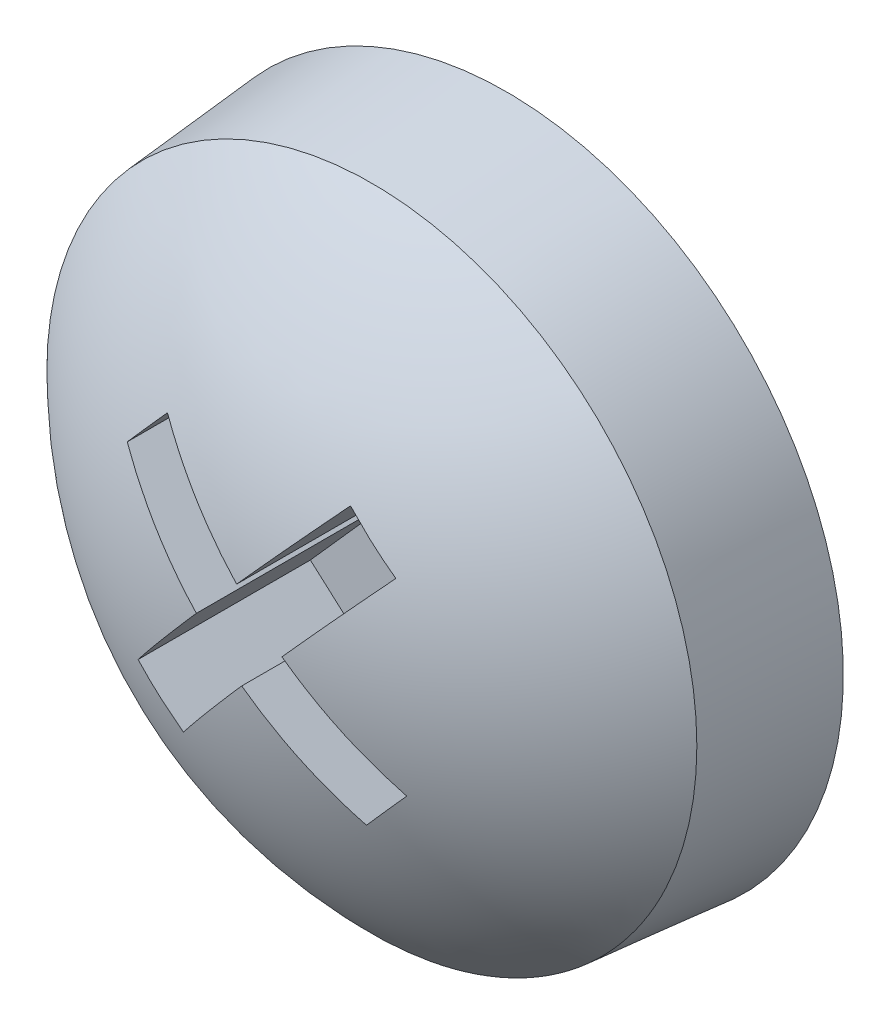
ISO-10303-21;
HEADER;
FILE_DESCRIPTION(('STEP AP214'),'2;1');
FILE_NAME('part.step','',(''),(''),'','','');
FILE_SCHEMA(('AUTOMOTIVE_DESIGN { 1 0 10303 214 1 1 1 1 }'));
ENDSEC;
DATA;
#1=APPLICATION_CONTEXT('core data for automotive mechanical design processes');
#2=APPLICATION_PROTOCOL_DEFINITION('international standard','automotive_design',2000,#1);
#3=PRODUCT_CONTEXT('',#1,'mechanical');
#4=PRODUCT('Part','Part','',(#3));
#5=PRODUCT_RELATED_PRODUCT_CATEGORY('part','',(#4));
#6=PRODUCT_DEFINITION_FORMATION('','',#4);
#7=PRODUCT_DEFINITION_CONTEXT('part definition',#1,'design');
#8=PRODUCT_DEFINITION('design','',#6,#7);
#9=PRODUCT_DEFINITION_SHAPE('','',#8);
#10=(LENGTH_UNIT() NAMED_UNIT(*) SI_UNIT(.MILLI.,.METRE.));
#11=(NAMED_UNIT(*) PLANE_ANGLE_UNIT() SI_UNIT($,.RADIAN.));
#12=(NAMED_UNIT(*) SI_UNIT($,.STERADIAN.) SOLID_ANGLE_UNIT());
#13=UNCERTAINTY_MEASURE_WITH_UNIT(LENGTH_MEASURE(1.E-05),#10,'distance_accuracy_value','');
#14=(GEOMETRIC_REPRESENTATION_CONTEXT(3) GLOBAL_UNCERTAINTY_ASSIGNED_CONTEXT((#13)) GLOBAL_UNIT_ASSIGNED_CONTEXT((#10,
#11,#12)) REPRESENTATION_CONTEXT('',''));
#15=CARTESIAN_POINT('',(0.,0.,0.));
#16=DIRECTION('',(0.,0.,1.));
#17=DIRECTION('',(1.,0.,0.));
#18=AXIS2_PLACEMENT_3D('',#15,#16,#17);
#19=CARTESIAN_POINT('',(6.89997712496555,4.50501230247056,21.6));
#20=DIRECTION('',(0.,0.,1.));
#21=DIRECTION('',(0.,-1.,0.));
#22=AXIS2_PLACEMENT_3D('',#19,#20,#21);
#23=PLANE('',#22);
#24=DIRECTION('',(0.747876143588401,-0.66383828893138,0.));
#25=VECTOR('',#24,1.);
#26=CARTESIAN_POINT('',(7.0194680169732,4.63963000831647,21.6));
#27=LINE('',#26,#25);
#28=CARTESIAN_POINT('',(7.15408572281911,4.52013911630882,21.6));
#29=VERTEX_POINT('',#28);
#30=CARTESIAN_POINT('',(7.72995035338218,4.00898363383166,21.6));
#31=VERTEX_POINT('',#30);
#32=EDGE_CURVE('E84',#29,#31,#27,.T.);
#33=ORIENTED_EDGE('',*,*,#32,.F.);
#34=DIRECTION('',(-0.66383828893138,-0.747876143588401,0.));
#35=VECTOR('',#34,1.);
#36=CARTESIAN_POINT('',(7.03459483081146,4.38552141046291,21.6));
#37=LINE('',#36,#35);
#38=CARTESIAN_POINT('',(7.66524120529627,5.09600374687189,21.6));
#39=VERTEX_POINT('',#38);
#40=EDGE_CURVE('E89',#39,#29,#37,.T.);
#41=ORIENTED_EDGE('',*,*,#40,.F.);
#42=DIRECTION('',(0.747876143588401,-0.66383828893138,0.));
#43=VECTOR('',#42,1.);
#44=CARTESIAN_POINT('',(7.53062349945036,5.21549463887954,21.6));
#45=LINE('',#44,#43);
#46=CARTESIAN_POINT('',(7.39600579360445,5.33498553088719,21.6));
#47=VERTEX_POINT('',#46);
#48=EDGE_CURVE('E140',#47,#39,#45,.T.);
#49=ORIENTED_EDGE('',*,*,#48,.F.);
#50=DIRECTION('',(0.66383828893138,0.747876143588401,0.));
#51=VECTOR('',#50,1.);
#52=CARTESIAN_POINT('',(6.76535941911964,4.62450319447821,21.6));
#53=LINE('',#52,#51);
#54=CARTESIAN_POINT('',(6.88485031112729,4.75912090032412,21.6));
#55=VERTEX_POINT('',#54);
#56=EDGE_CURVE('E151',#55,#47,#53,.T.);
#57=ORIENTED_EDGE('',*,*,#56,.F.);
#58=DIRECTION('',(0.747876143588401,-0.66383828893138,0.));
#59=VECTOR('',#58,1.);
#60=CARTESIAN_POINT('',(7.0194680169732,4.63963000831647,21.6));
#61=LINE('',#60,#59);
#62=CARTESIAN_POINT('',(6.30898568056422,5.27027638280128,21.6));
#63=VERTEX_POINT('',#62);
#64=EDGE_CURVE('E154',#63,#55,#61,.T.);
#65=ORIENTED_EDGE('',*,*,#64,.F.);
#66=DIRECTION('',(0.66383828893138,0.747876143588401,0.));
#67=VECTOR('',#66,1.);
#68=CARTESIAN_POINT('',(6.18949478855657,5.13565867695537,21.6));
#69=LINE('',#68,#67);
#70=CARTESIAN_POINT('',(6.07000389654892,5.00104097110945,21.6));
#71=VERTEX_POINT('',#70);
#72=EDGE_CURVE('E162',#71,#63,#69,.T.);
#73=ORIENTED_EDGE('',*,*,#72,.F.);
#74=DIRECTION('',(-0.747876143588401,0.66383828893138,0.));
#75=VECTOR('',#74,1.);
#76=CARTESIAN_POINT('',(6.7804862329579,4.37039459662465,21.6));
#77=LINE('',#76,#75);
#78=CARTESIAN_POINT('',(6.64586852711199,4.4898854886323,21.6));
#79=VERTEX_POINT('',#78);
#80=EDGE_CURVE('E167',#79,#71,#77,.T.);
#81=ORIENTED_EDGE('',*,*,#80,.F.);
#82=DIRECTION('',(0.66383828893138,0.747876143588401,0.));
#83=VECTOR('',#82,1.);
#84=CARTESIAN_POINT('',(6.76535941911964,4.62450319447821,21.6));
#85=LINE('',#84,#83);
#86=CARTESIAN_POINT('',(6.13471304463483,3.91402085806923,21.6));
#87=VERTEX_POINT('',#86);
#88=EDGE_CURVE('E172',#87,#79,#85,.T.);
#89=ORIENTED_EDGE('',*,*,#88,.F.);
#90=DIRECTION('',(0.747876143588401,-0.66383828893138,0.));
#91=VECTOR('',#90,1.);
#92=CARTESIAN_POINT('',(6.26933075048074,3.79452996606158,21.6));
#93=LINE('',#92,#91);
#94=CARTESIAN_POINT('',(6.40394845632666,3.67503907405393,21.6));
#95=VERTEX_POINT('',#94);
#96=EDGE_CURVE('E178',#87,#95,#93,.T.);
#97=ORIENTED_EDGE('',*,*,#96,.T.);
#98=DIRECTION('',(-0.66383828893138,-0.747876143588401,0.));
#99=VECTOR('',#98,1.);
#100=CARTESIAN_POINT('',(7.03459483081146,4.38552141046291,21.6));
#101=LINE('',#100,#99);
#102=CARTESIAN_POINT('',(6.91510393880381,4.250903704617,21.6));
#103=VERTEX_POINT('',#102);
#104=EDGE_CURVE('E183',#103,#95,#101,.T.);
#105=ORIENTED_EDGE('',*,*,#104,.F.);
#106=DIRECTION('',(-0.747876143588401,0.66383828893138,0.));
#107=VECTOR('',#106,1.);
#108=CARTESIAN_POINT('',(6.7804862329579,4.37039459662465,21.6));
#109=LINE('',#108,#107);
#110=CARTESIAN_POINT('',(7.49096856936688,3.73974822213984,21.6));
#111=VERTEX_POINT('',#110);
#112=EDGE_CURVE('E119',#111,#103,#109,.T.);
#113=ORIENTED_EDGE('',*,*,#112,.F.);
#114=DIRECTION('',(0.66383828893138,0.747876143588401,0.));
#115=VECTOR('',#114,1.);
#116=CARTESIAN_POINT('',(7.61045946137453,3.87436592798575,21.6));
#117=LINE('',#116,#115);
#118=EDGE_CURVE('E117',#111,#31,#117,.T.);
#119=ORIENTED_EDGE('',*,*,#118,.T.);
#120=EDGE_LOOP('',(#33,#41,#49,#57,#65,#73,#81,#89,#97,#105,#113,#119));
#121=FACE_BOUND('',#120,.T.);
#122=ADVANCED_FACE('F17',(#121),#23,.T.);
#123=CARTESIAN_POINT('',(7.0194680169732,4.63963000831647,22.2));
#124=DIRECTION('',(-0.66383828893138,-0.747876143588401,0.));
#125=DIRECTION('',(0.747876143588401,-0.66383828893138,0.));
#126=AXIS2_PLACEMENT_3D('',#123,#124,#125);
#127=PLANE('',#126);
#128=DIRECTION('',(0.,0.,1.));
#129=VECTOR('',#128,1.);
#130=CARTESIAN_POINT('',(7.15408572281911,4.52013911630882,22.2));
#131=LINE('',#130,#129);
#132=CARTESIAN_POINT('',(7.15408572281911,4.52013911630882,22.788097569794));
#133=VERTEX_POINT('',#132);
#134=EDGE_CURVE('E127',#29,#133,#131,.T.);
#135=ORIENTED_EDGE('',*,*,#134,.F.);
#136=ORIENTED_EDGE('',*,*,#32,.T.);
#137=DIRECTION('',(0.,0.,1.));
#138=VECTOR('',#137,1.);
#139=CARTESIAN_POINT('',(7.72995035338218,4.00898363383166,22.2));
#140=LINE('',#139,#138);
#141=CARTESIAN_POINT('',(7.72995035338218,4.00898363383166,22.6229045231911));
#142=VERTEX_POINT('',#141);
#143=EDGE_CURVE('E123',#31,#142,#140,.T.);
#144=ORIENTED_EDGE('',*,*,#143,.T.);
#145=CARTESIAN_POINT('',(7.15408572281911,4.52013911630882,22.788097569794));
#146=CARTESIAN_POINT('',(7.17877165659901,4.49822710830909,22.7859104299673));
#147=CARTESIAN_POINT('',(7.20342772135599,4.47634161298961,22.7831210421487));
#148=CARTESIAN_POINT('',(7.25255070327682,4.43273851567851,22.7763560552392));
#149=CARTESIAN_POINT('',(7.27701798297534,4.41102059188977,22.7723851623111));
#150=CARTESIAN_POINT('',(7.32576464164366,4.36775153088425,22.7632701136372));
#151=CARTESIAN_POINT('',(7.35004434494988,4.34620010577631,22.7581290588921));
#152=CARTESIAN_POINT('',(7.39841672115628,4.30326326960671,22.7466823115268));
#153=CARTESIAN_POINT('',(7.42250959829504,4.2818776772565,22.7403781619621));
#154=CARTESIAN_POINT('',(7.47050909335735,4.23927182206924,22.7266089835755));
#155=CARTESIAN_POINT('',(7.49441571128089,4.2180515592322,22.7191439547536));
#156=CARTESIAN_POINT('',(7.5420428123996,4.17577625257286,22.703052205587));
#157=CARTESIAN_POINT('',(7.56576300849104,4.15472146359282,22.6944239659575));
#158=CARTESIAN_POINT('',(7.61301615058749,4.11277809467423,22.6760004253173));
#159=CARTESIAN_POINT('',(7.63654844108106,4.09189009658817,22.666202118307));
#160=CARTESIAN_POINT('',(7.68342385204351,4.05028201365486,22.6454289197685));
#161=CARTESIAN_POINT('',(7.70676585941599,4.02956291682685,22.6344495373844));
#162=CARTESIAN_POINT('',(7.72995035338216,4.00898363383167,22.622904523191));
#163=B_SPLINE_CURVE_WITH_KNOTS('',3,(#145,#146,#147,#148,#149,#150,#151,#152,#153,#154,#155,
#156,#157,#158,#159,#160,#161,#162),.UNSPECIFIED.,.F.,.F.,(4,2,2,2,2,2,2,2,4),(0.,
0.0992357442434159,0.198081387639265,0.296668072480489,0.395124892694088,0.493581712907686,
0.59216839774891,0.691014041144759,0.790249785388174),.UNSPECIFIED.);
#164=EDGE_CURVE('E20',#133,#142,#163,.T.);
#165=ORIENTED_EDGE('',*,*,#164,.F.);
#166=EDGE_LOOP('',(#135,#136,#144,#165));
#167=FACE_BOUND('',#166,.T.);
#168=ADVANCED_FACE('F125',(#167),#127,.T.);
#169=CARTESIAN_POINT('',(7.61045946137453,3.87436592798575,22.2));
#170=DIRECTION('',(0.747876143588401,-0.66383828893138,0.));
#171=DIRECTION('',(0.66383828893138,0.747876143588401,0.));
#172=AXIS2_PLACEMENT_3D('',#169,#170,#171);
#173=PLANE('',#172);
#174=ORIENTED_EDGE('',*,*,#118,.F.);
#175=DIRECTION('',(0.,0.,1.));
#176=VECTOR('',#175,1.);
#177=CARTESIAN_POINT('',(7.49096856936688,3.73974822213984,22.2));
#178=LINE('',#177,#176);
#179=CARTESIAN_POINT('',(7.49096856936687,3.73974822213984,22.6229045231911));
#180=VERTEX_POINT('',#179);
#181=EDGE_CURVE('E132',#180,#111,#178,.F.);
#182=ORIENTED_EDGE('',*,*,#181,.F.);
#183=CARTESIAN_POINT('',(7.72995035338218,4.00898363383166,22.622904523191));
#184=CARTESIAN_POINT('',(7.69012005604629,3.96411106521635,22.6271329188894));
#185=CARTESIAN_POINT('',(7.65028975871041,3.91923849660105,22.6292471167385));
#186=CARTESIAN_POINT('',(7.57062916403865,3.82949335937045,22.6292471167385));
#187=CARTESIAN_POINT('',(7.53079886670277,3.78462079075514,22.6271329188894));
#188=CARTESIAN_POINT('',(7.49096856936688,3.73974822213984,22.622904523191));
#189=B_SPLINE_CURVE_WITH_KNOTS('',3,(#183,#184,#185,#186,#187,#188),.UNSPECIFIED.,.F.,.F.,(4,2,
4),(0.,0.180111711148685,0.360223422297369),.UNSPECIFIED.);
#190=EDGE_CURVE('E131',#142,#180,#189,.T.);
#191=ORIENTED_EDGE('',*,*,#190,.F.);
#192=ORIENTED_EDGE('',*,*,#143,.F.);
#193=EDGE_LOOP('',(#174,#182,#191,#192));
#194=FACE_BOUND('',#193,.T.);
#195=ADVANCED_FACE('F129',(#194),#173,.F.);
#196=CARTESIAN_POINT('',(6.7804862329579,4.37039459662465,22.2));
#197=DIRECTION('',(0.66383828893138,0.747876143588401,0.));
#198=DIRECTION('',(-0.747876143588401,0.66383828893138,0.));
#199=AXIS2_PLACEMENT_3D('',#196,#197,#198);
#200=PLANE('',#199);
#201=DIRECTION('',(0.,0.,1.));
#202=VECTOR('',#201,1.);
#203=CARTESIAN_POINT('',(6.91510393880381,4.250903704617,22.2));
#204=LINE('',#203,#202);
#205=CARTESIAN_POINT('',(6.91510393880381,4.250903704617,22.788097569794));
#206=VERTEX_POINT('',#205);
#207=EDGE_CURVE('E180',#206,#103,#204,.F.);
#208=ORIENTED_EDGE('',*,*,#207,.F.);
#209=CARTESIAN_POINT('',(7.49096856936687,3.73974822213985,22.622904523191));
#210=CARTESIAN_POINT('',(7.46778407540069,3.76032750513502,22.6344495373844));
#211=CARTESIAN_POINT('',(7.44444206802821,3.78104660196304,22.6454289197685));
#212=CARTESIAN_POINT('',(7.39756665706576,3.82265468489635,22.666202118307));
#213=CARTESIAN_POINT('',(7.37403436657219,3.84354268298241,22.6760004253173));
#214=CARTESIAN_POINT('',(7.32678122447574,3.885486051901,22.6944239659575));
#215=CARTESIAN_POINT('',(7.3030610283843,3.90654084088104,22.703052205587));
#216=CARTESIAN_POINT('',(7.25543392726559,3.94881614754038,22.7191439547536));
#217=CARTESIAN_POINT('',(7.23152730934205,3.97003641037742,22.7266089835755));
#218=CARTESIAN_POINT('',(7.18352781427975,4.01264226556468,22.7403781619621));
#219=CARTESIAN_POINT('',(7.15943493714099,4.03402785791489,22.7466823115268));
#220=CARTESIAN_POINT('',(7.11106256093458,4.07696469408448,22.7581290588921));
#221=CARTESIAN_POINT('',(7.08678285762836,4.09851611919243,22.7632701136372));
#222=CARTESIAN_POINT('',(7.03803619896004,4.14178518019794,22.7723851623111));
#223=CARTESIAN_POINT('',(7.01356891926152,4.16350310398668,22.7763560552392));
#224=CARTESIAN_POINT('',(6.96444593734069,4.20710620129778,22.7831210421487));
#225=CARTESIAN_POINT('',(6.93978987258371,4.22899169661727,22.7859104299673));
#226=CARTESIAN_POINT('',(6.91510393880381,4.250903704617,22.788097569794));
#227=B_SPLINE_CURVE_WITH_KNOTS('',3,(#209,#210,#211,#212,#213,#214,#215,#216,#217,#218,#219,
#220,#221,#222,#223,#224,#225,#226),.UNSPECIFIED.,.F.,.F.,(4,2,2,2,2,2,2,2,4),(0.,
0.0992357442434137,0.198081387639264,0.296668072480488,0.395124892694088,0.493581712907684,
0.59216839774891,0.691014041144758,0.790249785388173),.UNSPECIFIED.);
#228=EDGE_CURVE('E296',#180,#206,#227,.T.);
#229=ORIENTED_EDGE('',*,*,#228,.F.);
#230=ORIENTED_EDGE('',*,*,#181,.T.);
#231=ORIENTED_EDGE('',*,*,#112,.T.);
#232=EDGE_LOOP('',(#208,#229,#230,#231));
#233=FACE_BOUND('',#232,.T.);
#234=ADVANCED_FACE('F305',(#233),#200,.T.);
#235=CARTESIAN_POINT('',(7.03459483081146,4.38552141046291,22.2));
#236=DIRECTION('',(-0.747876143588401,0.66383828893138,0.));
#237=DIRECTION('',(-0.66383828893138,-0.747876143588401,0.));
#238=AXIS2_PLACEMENT_3D('',#235,#236,#237);
#239=PLANE('',#238);
#240=CARTESIAN_POINT('',(6.91510393880381,4.250903704617,22.788097569794));
#241=CARTESIAN_POINT('',(6.89319193080408,4.2262177708371,22.7859104299673));
#242=CARTESIAN_POINT('',(6.8713064354846,4.20156170608012,22.7831210421487));
#243=CARTESIAN_POINT('',(6.8277033381735,4.15243872415929,22.7763560552392));
#244=CARTESIAN_POINT('',(6.80598541438476,4.12797144446077,22.7723851623111));
#245=CARTESIAN_POINT('',(6.76271635337924,4.07922478579245,22.7632701136372));
#246=CARTESIAN_POINT('',(6.7411649282713,4.05494508248623,22.7581290588921));
#247=CARTESIAN_POINT('',(6.6982280921017,4.00657270627983,22.7466823115268));
#248=CARTESIAN_POINT('',(6.67684249975149,3.98247982914107,22.740378161962));
#249=CARTESIAN_POINT('',(6.63423664456424,3.93448033407876,22.7266089835755));
#250=CARTESIAN_POINT('',(6.61301638172719,3.91057371615522,22.7191439547536));
#251=CARTESIAN_POINT('',(6.57074107506785,3.86294661503651,22.703052205587));
#252=CARTESIAN_POINT('',(6.54968628608781,3.83922641894507,22.6944239659575));
#253=CARTESIAN_POINT('',(6.50774291716923,3.79197327684862,22.6760004253173));
#254=CARTESIAN_POINT('',(6.48685491908316,3.76844098635505,22.666202118307));
#255=CARTESIAN_POINT('',(6.44524683614985,3.7215655753926,22.6454289197685));
#256=CARTESIAN_POINT('',(6.42452773932184,3.69822356802012,22.6344495373844));
#257=CARTESIAN_POINT('',(6.40394845632667,3.67503907405395,22.622904523191));
#258=B_SPLINE_CURVE_WITH_KNOTS('',3,(#240,#241,#242,#243,#244,#245,#246,#247,#248,#249,#250,
#251,#252,#253,#254,#255,#256,#257),.UNSPECIFIED.,.F.,.F.,(4,2,2,2,2,2,2,2,4),(0.,
0.0992357442434143,0.198081387639265,0.29666807248049,0.395124892694087,0.493581712907686,
0.59216839774891,0.691014041144758,0.790249785388174),.UNSPECIFIED.);
#259=CARTESIAN_POINT('',(6.40394845632665,3.67503907405393,22.6229045231911));
#260=VERTEX_POINT('',#259);
#261=EDGE_CURVE('E289',#206,#260,#258,.T.);
#262=ORIENTED_EDGE('',*,*,#261,.F.);
#263=ORIENTED_EDGE('',*,*,#207,.T.);
#264=ORIENTED_EDGE('',*,*,#104,.T.);
#265=DIRECTION('',(0.,0.,1.));
#266=VECTOR('',#265,1.);
#267=CARTESIAN_POINT('',(6.40394845632666,3.67503907405393,22.2));
#268=LINE('',#267,#266);
#269=EDGE_CURVE('E175',#95,#260,#268,.T.);
#270=ORIENTED_EDGE('',*,*,#269,.T.);
#271=EDGE_LOOP('',(#262,#263,#264,#270));
#272=FACE_BOUND('',#271,.T.);
#273=ADVANCED_FACE('F302',(#272),#239,.T.);
#274=CARTESIAN_POINT('',(6.26933075048074,3.79452996606158,22.2));
#275=DIRECTION('',(-0.66383828893138,-0.747876143588401,0.));
#276=DIRECTION('',(0.747876143588401,-0.66383828893138,0.));
#277=AXIS2_PLACEMENT_3D('',#274,#275,#276);
#278=PLANE('',#277);
#279=ORIENTED_EDGE('',*,*,#96,.F.);
#280=DIRECTION('',(0.,0.,1.));
#281=VECTOR('',#280,1.);
#282=CARTESIAN_POINT('',(6.13471304463483,3.91402085806923,22.2));
#283=LINE('',#282,#281);
#284=CARTESIAN_POINT('',(6.13471304463484,3.91402085806924,22.6229045231911));
#285=VERTEX_POINT('',#284);
#286=EDGE_CURVE('E174',#285,#87,#283,.F.);
#287=ORIENTED_EDGE('',*,*,#286,.F.);
#288=CARTESIAN_POINT('',(6.40394845632665,3.67503907405393,22.622904523191));
#289=CARTESIAN_POINT('',(6.35907588771134,3.71486937138982,22.6271329188894));
#290=CARTESIAN_POINT('',(6.31420331909604,3.7546996687257,22.6292471167385));
#291=CARTESIAN_POINT('',(6.22445818186544,3.83436026339746,22.6292471167385));
#292=CARTESIAN_POINT('',(6.17958561325013,3.87419056073334,22.6271329188894));
#293=CARTESIAN_POINT('',(6.13471304463483,3.91402085806922,22.622904523191));
#294=B_SPLINE_CURVE_WITH_KNOTS('',3,(#288,#289,#290,#291,#292,#293),.UNSPECIFIED.,.F.,.F.,(4,2,
4),(0.,0.180111711148683,0.360223422297365),.UNSPECIFIED.);
#295=EDGE_CURVE('E282',#260,#285,#294,.T.);
#296=ORIENTED_EDGE('',*,*,#295,.F.);
#297=ORIENTED_EDGE('',*,*,#269,.F.);
#298=EDGE_LOOP('',(#279,#287,#296,#297));
#299=FACE_BOUND('',#298,.T.);
#300=ADVANCED_FACE('F271',(#299),#278,.F.);
#301=CARTESIAN_POINT('',(6.76535941911964,4.62450319447821,22.2));
#302=DIRECTION('',(0.747876143588401,-0.66383828893138,0.));
#303=DIRECTION('',(0.66383828893138,0.747876143588401,0.));
#304=AXIS2_PLACEMENT_3D('',#301,#302,#303);
#305=PLANE('',#304);
#306=CARTESIAN_POINT('',(6.13471304463484,3.91402085806925,22.622904523191));
#307=CARTESIAN_POINT('',(6.15529232763002,3.93720535203542,22.6344495373844));
#308=CARTESIAN_POINT('',(6.17601142445803,3.9605473594079,22.6454289197685));
#309=CARTESIAN_POINT('',(6.21761950739134,4.00742277037035,22.666202118307));
#310=CARTESIAN_POINT('',(6.23850750547741,4.03095506086392,22.6760004253173));
#311=CARTESIAN_POINT('',(6.28045087439599,4.07820820296037,22.6944239659575));
#312=CARTESIAN_POINT('',(6.30150566337603,4.10192839905181,22.703052205587));
#313=CARTESIAN_POINT('',(6.34378097003537,4.14955550017052,22.7191439547536));
#314=CARTESIAN_POINT('',(6.36500123287242,4.17346211809406,22.7266089835755));
#315=CARTESIAN_POINT('',(6.40760708805967,4.22146161315636,22.7403781619621));
#316=CARTESIAN_POINT('',(6.42899268040988,4.24555449029512,22.7466823115268));
#317=CARTESIAN_POINT('',(6.47192951657947,4.29392686650153,22.7581290588921));
#318=CARTESIAN_POINT('',(6.49348094168742,4.31820656980775,22.7632701136372));
#319=CARTESIAN_POINT('',(6.53675000269294,4.36695322847607,22.7723851623111));
#320=CARTESIAN_POINT('',(6.55846792648168,4.39142050817459,22.7763560552392));
#321=CARTESIAN_POINT('',(6.60207102379277,4.44054349009542,22.7831210421487));
#322=CARTESIAN_POINT('',(6.62395651911226,4.4651995548524,22.7859104299673));
#323=CARTESIAN_POINT('',(6.64586852711199,4.4898854886323,22.788097569794));
#324=B_SPLINE_CURVE_WITH_KNOTS('',3,(#306,#307,#308,#309,#310,#311,#312,#313,#314,#315,#316,
#317,#318,#319,#320,#321,#322,#323),.UNSPECIFIED.,.F.,.F.,(4,2,2,2,2,2,2,2,4),(0.,
0.0992357442434144,0.198081387639263,0.296668072480489,0.395124892694086,0.493581712907683,
0.592168397748908,0.691014041144757,0.790249785388172),.UNSPECIFIED.);
#325=CARTESIAN_POINT('',(6.64586852711199,4.4898854886323,22.788097569794));
#326=VERTEX_POINT('',#325);
#327=EDGE_CURVE('E275',#285,#326,#324,.T.);
#328=ORIENTED_EDGE('',*,*,#327,.F.);
#329=ORIENTED_EDGE('',*,*,#286,.T.);
#330=ORIENTED_EDGE('',*,*,#88,.T.);
#331=DIRECTION('',(0.,0.,1.));
#332=VECTOR('',#331,1.);
#333=CARTESIAN_POINT('',(6.64586852711199,4.4898854886323,22.2));
#334=LINE('',#333,#332);
#335=EDGE_CURVE('E169',#326,#79,#334,.F.);
#336=ORIENTED_EDGE('',*,*,#335,.F.);
#337=EDGE_LOOP('',(#328,#329,#330,#336));
#338=FACE_BOUND('',#337,.T.);
#339=ADVANCED_FACE('F266',(#338),#305,.T.);
#340=CARTESIAN_POINT('',(6.7804862329579,4.37039459662465,22.2));
#341=DIRECTION('',(0.66383828893138,0.747876143588401,0.));
#342=DIRECTION('',(-0.747876143588401,0.66383828893138,0.));
#343=AXIS2_PLACEMENT_3D('',#340,#341,#342);
#344=PLANE('',#343);
#345=ORIENTED_EDGE('',*,*,#335,.T.);
#346=ORIENTED_EDGE('',*,*,#80,.T.);
#347=DIRECTION('',(0.,0.,1.));
#348=VECTOR('',#347,1.);
#349=CARTESIAN_POINT('',(6.07000389654892,5.00104097110945,22.2));
#350=LINE('',#349,#348);
#351=CARTESIAN_POINT('',(6.07000389654892,5.00104097110945,22.6229045231911));
#352=VERTEX_POINT('',#351);
#353=EDGE_CURVE('E164',#352,#71,#350,.F.);
#354=ORIENTED_EDGE('',*,*,#353,.F.);
#355=CARTESIAN_POINT('',(6.64586852711199,4.4898854886323,22.788097569794));
#356=CARTESIAN_POINT('',(6.62118259333209,4.51179749663203,22.7859104299673));
#357=CARTESIAN_POINT('',(6.59652652857511,4.53368299195151,22.7831210421487));
#358=CARTESIAN_POINT('',(6.54740354665428,4.57728608926261,22.7763560552392));
#359=CARTESIAN_POINT('',(6.52293626695576,4.59900401305135,22.7723851623111));
#360=CARTESIAN_POINT('',(6.47418960828744,4.64227307405687,22.7632701136372));
#361=CARTESIAN_POINT('',(6.44990990498122,4.66382449916481,22.7581290588921));
#362=CARTESIAN_POINT('',(6.40153752877482,4.70676133533441,22.7466823115268));
#363=CARTESIAN_POINT('',(6.37744465163606,4.72814692768462,22.740378161962));
#364=CARTESIAN_POINT('',(6.32944515657375,4.77075278287187,22.7266089835755));
#365=CARTESIAN_POINT('',(6.30553853865021,4.79197304570891,22.7191439547536));
#366=CARTESIAN_POINT('',(6.25791143753151,4.83424835236825,22.703052205587));
#367=CARTESIAN_POINT('',(6.23419124144006,4.8553031413483,22.6944239659575));
#368=CARTESIAN_POINT('',(6.18693809934361,4.89724651026688,22.6760004253173));
#369=CARTESIAN_POINT('',(6.16340580885004,4.91813450835295,22.666202118307));
#370=CARTESIAN_POINT('',(6.11653039788759,4.95974259128625,22.6454289197685));
#371=CARTESIAN_POINT('',(6.09318839051511,4.98046168811427,22.6344495373844));
#372=CARTESIAN_POINT('',(6.07000389654894,5.00104097110944,22.622904523191));
#373=B_SPLINE_CURVE_WITH_KNOTS('',3,(#355,#356,#357,#358,#359,#360,#361,#362,#363,#364,#365,
#366,#367,#368,#369,#370,#371,#372),.UNSPECIFIED.,.F.,.F.,(4,2,2,2,2,2,2,2,4),(0.,
0.0992357442434133,0.198081387639264,0.296668072480487,0.395124892694085,0.493581712907682,
0.592168397748905,0.691014041144755,0.790249785388168),.UNSPECIFIED.);
#374=EDGE_CURVE('E251',#326,#352,#373,.T.);
#375=ORIENTED_EDGE('',*,*,#374,.F.);
#376=EDGE_LOOP('',(#345,#346,#354,#375));
#377=FACE_BOUND('',#376,.T.);
#378=ADVANCED_FACE('F261',(#377),#344,.T.);
#379=CARTESIAN_POINT('',(6.18949478855657,5.13565867695537,22.2));
#380=DIRECTION('',(0.747876143588401,-0.66383828893138,0.));
#381=DIRECTION('',(0.66383828893138,0.747876143588401,0.));
#382=AXIS2_PLACEMENT_3D('',#379,#380,#381);
#383=PLANE('',#382);
#384=ORIENTED_EDGE('',*,*,#353,.T.);
#385=ORIENTED_EDGE('',*,*,#72,.T.);
#386=DIRECTION('',(0.,0.,1.));
#387=VECTOR('',#386,1.);
#388=CARTESIAN_POINT('',(6.30898568056422,5.27027638280128,22.2));
#389=LINE('',#388,#387);
#390=CARTESIAN_POINT('',(6.30898568056423,5.27027638280127,22.6229045231911));
#391=VERTEX_POINT('',#390);
#392=EDGE_CURVE('E159',#391,#63,#389,.F.);
#393=ORIENTED_EDGE('',*,*,#392,.F.);
#394=CARTESIAN_POINT('',(6.07000389654892,5.00104097110946,22.622904523191));
#395=CARTESIAN_POINT('',(6.1098341938848,5.04591353972476,22.6271329188894));
#396=CARTESIAN_POINT('',(6.14966449122069,5.09078610834006,22.6292471167385));
#397=CARTESIAN_POINT('',(6.22932508589245,5.18053124557067,22.6292471167385));
#398=CARTESIAN_POINT('',(6.26915538322833,5.22540381418597,22.6271329188894));
#399=CARTESIAN_POINT('',(6.30898568056421,5.27027638280128,22.622904523191));
#400=B_SPLINE_CURVE_WITH_KNOTS('',3,(#394,#395,#396,#397,#398,#399),.UNSPECIFIED.,.F.,.F.,(4,2,
4),(0.,0.180111711148686,0.360223422297372),.UNSPECIFIED.);
#401=EDGE_CURVE('E244',#352,#391,#400,.T.);
#402=ORIENTED_EDGE('',*,*,#401,.F.);
#403=EDGE_LOOP('',(#384,#385,#393,#402));
#404=FACE_BOUND('',#403,.T.);
#405=ADVANCED_FACE('F258',(#404),#383,.T.);
#406=CARTESIAN_POINT('',(7.0194680169732,4.63963000831647,22.2));
#407=DIRECTION('',(-0.66383828893138,-0.747876143588401,0.));
#408=DIRECTION('',(0.747876143588401,-0.66383828893138,0.));
#409=AXIS2_PLACEMENT_3D('',#406,#407,#408);
#410=PLANE('',#409);
#411=DIRECTION('',(0.,0.,1.));
#412=VECTOR('',#411,1.);
#413=CARTESIAN_POINT('',(6.88485031112729,4.75912090032412,22.2));
#414=LINE('',#413,#412);
#415=CARTESIAN_POINT('',(6.88485031112729,4.75912090032412,22.788097569794));
#416=VERTEX_POINT('',#415);
#417=EDGE_CURVE('E143',#416,#55,#414,.F.);
#418=ORIENTED_EDGE('',*,*,#417,.F.);
#419=CARTESIAN_POINT('',(6.30898568056423,5.27027638280127,22.622904523191));
#420=CARTESIAN_POINT('',(6.3321701745304,5.2496970998061,22.6344495373844));
#421=CARTESIAN_POINT('',(6.35551218190288,5.22897800297808,22.6454289197685));
#422=CARTESIAN_POINT('',(6.40238759286533,5.18736992004477,22.666202118307));
#423=CARTESIAN_POINT('',(6.42591988335891,5.16648192195871,22.6760004253173));
#424=CARTESIAN_POINT('',(6.47317302545535,5.12453855304012,22.6944239659575));
#425=CARTESIAN_POINT('',(6.4968932215468,5.10348376406008,22.703052205587));
#426=CARTESIAN_POINT('',(6.54452032266551,5.06120845740074,22.7191439547536));
#427=CARTESIAN_POINT('',(6.56842694058905,5.03998819456369,22.7266089835755));
#428=CARTESIAN_POINT('',(6.61642643565135,4.99738233937644,22.740378161962));
#429=CARTESIAN_POINT('',(6.64051931279011,4.97599674702623,22.7466823115268));
#430=CARTESIAN_POINT('',(6.68889168899652,4.93305991085663,22.7581290588921));
#431=CARTESIAN_POINT('',(6.71317139230274,4.91150848574869,22.7632701136372));
#432=CARTESIAN_POINT('',(6.76191805097105,4.86823942474317,22.7723851623111));
#433=CARTESIAN_POINT('',(6.78638533066957,4.84652150095443,22.7763560552392));
#434=CARTESIAN_POINT('',(6.83550831259041,4.80291840364334,22.7831210421487));
#435=CARTESIAN_POINT('',(6.86016437734739,4.78103290832385,22.7859104299673));
#436=CARTESIAN_POINT('',(6.88485031112729,4.75912090032412,22.788097569794));
#437=B_SPLINE_CURVE_WITH_KNOTS('',3,(#419,#420,#421,#422,#423,#424,#425,#426,#427,#428,#429,
#430,#431,#432,#433,#434,#435,#436),.UNSPECIFIED.,.F.,.F.,(4,2,2,2,2,2,2,2,4),(0.,
0.0992357442434146,0.198081387639264,0.296668072480489,0.395124892694087,0.493581712907685,
0.59216839774891,0.691014041144759,0.790249785388175),.UNSPECIFIED.);
#438=EDGE_CURVE('E237',#391,#416,#437,.T.);
#439=ORIENTED_EDGE('',*,*,#438,.F.);
#440=ORIENTED_EDGE('',*,*,#392,.T.);
#441=ORIENTED_EDGE('',*,*,#64,.T.);
#442=EDGE_LOOP('',(#418,#439,#440,#441));
#443=FACE_BOUND('',#442,.T.);
#444=ADVANCED_FACE('F226',(#443),#410,.T.);
#445=CARTESIAN_POINT('',(6.76535941911964,4.62450319447821,22.2));
#446=DIRECTION('',(0.747876143588401,-0.66383828893138,0.));
#447=DIRECTION('',(0.66383828893138,0.747876143588401,0.));
#448=AXIS2_PLACEMENT_3D('',#445,#446,#447);
#449=PLANE('',#448);
#450=CARTESIAN_POINT('',(6.88485031112729,4.75912090032412,22.788097569794));
#451=CARTESIAN_POINT('',(6.90676231912702,4.78380683410401,22.7859104299673));
#452=CARTESIAN_POINT('',(6.9286478144465,4.808462898861,22.7831210421487));
#453=CARTESIAN_POINT('',(6.9722509117576,4.85758588078183,22.7763560552392));
#454=CARTESIAN_POINT('',(6.99396883554634,4.88205316048035,22.7723851623111));
#455=CARTESIAN_POINT('',(7.03723789655185,4.93079981914866,22.7632701136372));
#456=CARTESIAN_POINT('',(7.0587893216598,4.95507952245489,22.7581290588921));
#457=CARTESIAN_POINT('',(7.10172615782939,5.00345189866129,22.7466823115268));
#458=CARTESIAN_POINT('',(7.1231117501796,5.02754477580005,22.7403781619621));
#459=CARTESIAN_POINT('',(7.16571760536686,5.07554427086235,22.7266089835755));
#460=CARTESIAN_POINT('',(7.1869378682039,5.09945088878589,22.7191439547536));
#461=CARTESIAN_POINT('',(7.22921317486324,5.1470779899046,22.703052205587));
#462=CARTESIAN_POINT('',(7.25026796384328,5.17079818599605,22.6944239659575));
#463=CARTESIAN_POINT('',(7.29221133276187,5.21805132809249,22.6760004253173));
#464=CARTESIAN_POINT('',(7.31309933084793,5.24158361858606,22.666202118307));
#465=CARTESIAN_POINT('',(7.35470741378124,5.28845902954851,22.6454289197685));
#466=CARTESIAN_POINT('',(7.37542651060926,5.31180103692099,22.6344495373844));
#467=CARTESIAN_POINT('',(7.39600579360443,5.33498553088717,22.6229045231911));
#468=B_SPLINE_CURVE_WITH_KNOTS('',3,(#450,#451,#452,#453,#454,#455,#456,#457,#458,#459,#460,
#461,#462,#463,#464,#465,#466,#467),.UNSPECIFIED.,.F.,.F.,(4,2,2,2,2,2,2,2,4),(0.,
0.0992357442434121,0.198081387639262,0.296668072480484,0.395124892694081,0.493581712907677,
0.592168397748901,0.691014041144748,0.790249785388162),.UNSPECIFIED.);
#469=CARTESIAN_POINT('',(7.39600579360445,5.33498553088718,22.6229045231911));
#470=VERTEX_POINT('',#469);
#471=EDGE_CURVE('E230',#416,#470,#468,.T.);
#472=ORIENTED_EDGE('',*,*,#471,.F.);
#473=ORIENTED_EDGE('',*,*,#417,.T.);
#474=ORIENTED_EDGE('',*,*,#56,.T.);
#475=DIRECTION('',(0.,0.,1.));
#476=VECTOR('',#475,1.);
#477=CARTESIAN_POINT('',(7.39600579360445,5.33498553088718,22.2));
#478=LINE('',#477,#476);
#479=EDGE_CURVE('E142',#470,#47,#478,.F.);
#480=ORIENTED_EDGE('',*,*,#479,.F.);
#481=EDGE_LOOP('',(#472,#473,#474,#480));
#482=FACE_BOUND('',#481,.T.);
#483=ADVANCED_FACE('F222',(#482),#449,.T.);
#484=CARTESIAN_POINT('',(7.53062349945036,5.21549463887954,22.2));
#485=DIRECTION('',(-0.66383828893138,-0.747876143588401,0.));
#486=DIRECTION('',(0.747876143588401,-0.66383828893138,0.));
#487=AXIS2_PLACEMENT_3D('',#484,#485,#486);
#488=PLANE('',#487);
#489=CARTESIAN_POINT('',(7.39600579360445,5.33498553088718,22.622904523191));
#490=CARTESIAN_POINT('',(7.44087836221976,5.2951552335513,22.6271329188894));
#491=CARTESIAN_POINT('',(7.48575093083506,5.25532493621542,22.6292471167385));
#492=CARTESIAN_POINT('',(7.57549606806566,5.17566434154366,22.6292471167385));
#493=CARTESIAN_POINT('',(7.62036863668096,5.13583404420778,22.6271329188894));
#494=CARTESIAN_POINT('',(7.66524120529627,5.09600374687189,22.622904523191));
#495=B_SPLINE_CURVE_WITH_KNOTS('',3,(#489,#490,#491,#492,#493,#494),.UNSPECIFIED.,.F.,.F.,(4,2,
4),(0.,0.180111711148681,0.360223422297364),.UNSPECIFIED.);
#496=CARTESIAN_POINT('',(7.66524120529626,5.09600374687188,22.6229045231911));
#497=VERTEX_POINT('',#496);
#498=EDGE_CURVE('E203',#470,#497,#495,.T.);
#499=ORIENTED_EDGE('',*,*,#498,.F.);
#500=ORIENTED_EDGE('',*,*,#479,.T.);
#501=ORIENTED_EDGE('',*,*,#48,.T.);
#502=DIRECTION('',(0.,0.,1.));
#503=VECTOR('',#502,1.);
#504=CARTESIAN_POINT('',(7.66524120529627,5.09600374687189,22.2));
#505=LINE('',#504,#503);
#506=EDGE_CURVE('E40',#497,#39,#505,.F.);
#507=ORIENTED_EDGE('',*,*,#506,.F.);
#508=EDGE_LOOP('',(#499,#500,#501,#507));
#509=FACE_BOUND('',#508,.T.);
#510=ADVANCED_FACE('F217',(#509),#488,.T.);
#511=CARTESIAN_POINT('',(7.03459483081146,4.38552141046291,22.2));
#512=DIRECTION('',(-0.747876143588401,0.66383828893138,0.));
#513=DIRECTION('',(-0.66383828893138,-0.747876143588401,0.));
#514=AXIS2_PLACEMENT_3D('',#511,#512,#513);
#515=PLANE('',#514);
#516=CARTESIAN_POINT('',(7.66524120529626,5.09600374687187,22.622904523191));
#517=CARTESIAN_POINT('',(7.64466192230108,5.0728192529057,22.6344495373844));
#518=CARTESIAN_POINT('',(7.62394282547307,5.04947724553322,22.6454289197685));
#519=CARTESIAN_POINT('',(7.58233474253976,5.00260183457077,22.666202118307));
#520=CARTESIAN_POINT('',(7.5614467444537,4.9790695440772,22.6760004253173));
#521=CARTESIAN_POINT('',(7.51950337553511,4.93181640198075,22.6944239659575));
#522=CARTESIAN_POINT('',(7.49844858655507,4.90809620588931,22.703052205587));
#523=CARTESIAN_POINT('',(7.45617327989573,4.8604691047706,22.7191439547536));
#524=CARTESIAN_POINT('',(7.43495301705869,4.83656248684706,22.7266089835755));
#525=CARTESIAN_POINT('',(7.39234716187143,4.78856299178476,22.7403781619621));
#526=CARTESIAN_POINT('',(7.37096156952122,4.764470114646,22.7466823115268));
#527=CARTESIAN_POINT('',(7.32802473335163,4.71609773843959,22.7581290588921));
#528=CARTESIAN_POINT('',(7.30647330824368,4.69181803513337,22.7632701136372));
#529=CARTESIAN_POINT('',(7.26320424723816,4.64307137646505,22.7723851623111));
#530=CARTESIAN_POINT('',(7.24148632344942,4.61860409676653,22.7763560552392));
#531=CARTESIAN_POINT('',(7.19788322613833,4.5694811148457,22.7831210421487));
#532=CARTESIAN_POINT('',(7.17599773081884,4.54482505008872,22.7859104299673));
#533=CARTESIAN_POINT('',(7.15408572281911,4.52013911630882,22.788097569794));
#534=B_SPLINE_CURVE_WITH_KNOTS('',3,(#516,#517,#518,#519,#520,#521,#522,#523,#524,#525,#526,
#527,#528,#529,#530,#531,#532,#533),.UNSPECIFIED.,.F.,.F.,(4,2,2,2,2,2,2,2,4),(0.,
0.0992357442434151,0.198081387639266,0.296668072480488,0.395124892694087,0.493581712907684,
0.59216839774891,0.69101404114476,0.790249785388175),.UNSPECIFIED.);
#535=EDGE_CURVE('E195',#497,#133,#534,.T.);
#536=ORIENTED_EDGE('',*,*,#535,.F.);
#537=ORIENTED_EDGE('',*,*,#506,.T.);
#538=ORIENTED_EDGE('',*,*,#40,.T.);
#539=ORIENTED_EDGE('',*,*,#134,.T.);
#540=EDGE_LOOP('',(#536,#537,#538,#539));
#541=FACE_BOUND('',#540,.T.);
#542=ADVANCED_FACE('F214',(#541),#515,.T.);
#543=CARTESIAN_POINT('',(6.89997712496556,4.50501230247056,20.0719156205536));
#544=DIRECTION('',(0.46013350972689,-0.667997322687939,0.584856161896376));
#545=DIRECTION('',(0.,-0.658733272493452,-0.752376551807715));
#546=AXIS2_PLACEMENT_3D('',#543,#544,#545);
#547=SPHERICAL_SURFACE('',#546,2.72808437944638);
#548=ORIENTED_EDGE('',*,*,#498,.T.);
#549=ORIENTED_EDGE('',*,*,#535,.T.);
#550=ORIENTED_EDGE('',*,*,#164,.T.);
#551=ORIENTED_EDGE('',*,*,#190,.T.);
#552=ORIENTED_EDGE('',*,*,#228,.T.);
#553=ORIENTED_EDGE('',*,*,#261,.T.);
#554=ORIENTED_EDGE('',*,*,#295,.T.);
#555=ORIENTED_EDGE('',*,*,#327,.T.);
#556=ORIENTED_EDGE('',*,*,#374,.T.);
#557=ORIENTED_EDGE('',*,*,#401,.T.);
#558=ORIENTED_EDGE('',*,*,#438,.T.);
#559=ORIENTED_EDGE('',*,*,#471,.T.);
#560=EDGE_LOOP('',(#548,#549,#550,#551,#552,#553,#554,#555,#556,#557,#558,#559));
#561=FACE_BOUND('',#560,.T.);
#562=CARTESIAN_POINT('',(6.89997712496555,4.50501230247056,21.9999999999914));
#563=DIRECTION('',(0.,0.,-1.));
#564=DIRECTION('',(-1.,0.,0.));
#565=AXIS2_PLACEMENT_3D('',#562,#563,#564);
#566=CIRCLE('',#565,1.9300090691825);
#567=CARTESIAN_POINT('',(4.96996805578305,4.50501230247056,21.9999999999914));
#568=VERTEX_POINT('',#567);
#569=EDGE_CURVE('E31',#568,#568,#566,.T.);
#570=ORIENTED_EDGE('',*,*,#569,.F.);
#571=EDGE_LOOP('',(#570));
#572=FACE_BOUND('',#571,.T.);
#573=ADVANCED_FACE('F210',(#561,#572),#547,.T.);
#574=CARTESIAN_POINT('',(6.89997712496555,4.50501230247056,21.2000000000216));
#575=DIRECTION('',(0.,0.,-1.));
#576=DIRECTION('',(-1.,0.,0.));
#577=AXIS2_PLACEMENT_3D('',#574,#575,#576);
#578=CONICAL_SURFACE('',#577,2.00000000000248,0.0872664626020624);
#579=ORIENTED_EDGE('',*,*,#569,.T.);
#580=EDGE_LOOP('',(#579));
#581=FACE_BOUND('',#580,.T.);
#582=CARTESIAN_POINT('',(6.89997712496555,4.50501230247056,21.1999999999648));
#583=DIRECTION('',(0.,0.,-1.));
#584=DIRECTION('',(-1.,0.,0.));
#585=AXIS2_PLACEMENT_3D('',#582,#583,#584);
#586=CIRCLE('',#585,2.00000000000745);
#587=CARTESIAN_POINT('',(4.8999771249581,4.50501230247056,21.1999999999648));
#588=VERTEX_POINT('',#587);
#589=EDGE_CURVE('E11',#588,#588,#586,.T.);
#590=ORIENTED_EDGE('',*,*,#589,.F.);
#591=EDGE_LOOP('',(#590));
#592=FACE_BOUND('',#591,.T.);
#593=ADVANCED_FACE('F382',(#581,#592),#578,.T.);
#594=CARTESIAN_POINT('',(7.64785326855395,3.84117401353918,21.2));
#595=DIRECTION('',(0.,0.,-1.));
#596=DIRECTION('',(0.,1.,0.));
#597=AXIS2_PLACEMENT_3D('',#594,#595,#596);
#598=PLANE('',#597);
#599=ORIENTED_EDGE('',*,*,#589,.T.);
#600=EDGE_LOOP('',(#599));
#601=FACE_BOUND('',#600,.T.);
#602=ADVANCED_FACE('F380',(#601),#598,.T.);
#603=CLOSED_SHELL('',(#122,#168,#195,#234,#273,#300,#339,#378,#405,#444,#483,#510,#542,#573,
#593,#602));
#604=MANIFOLD_SOLID_BREP('B1',#603);
#605=ADVANCED_BREP_SHAPE_REPRESENTATION('',(#18,#604),#14);
#606=SHAPE_DEFINITION_REPRESENTATION(#9,#605);
ENDSEC;
END-ISO-10303-21;
